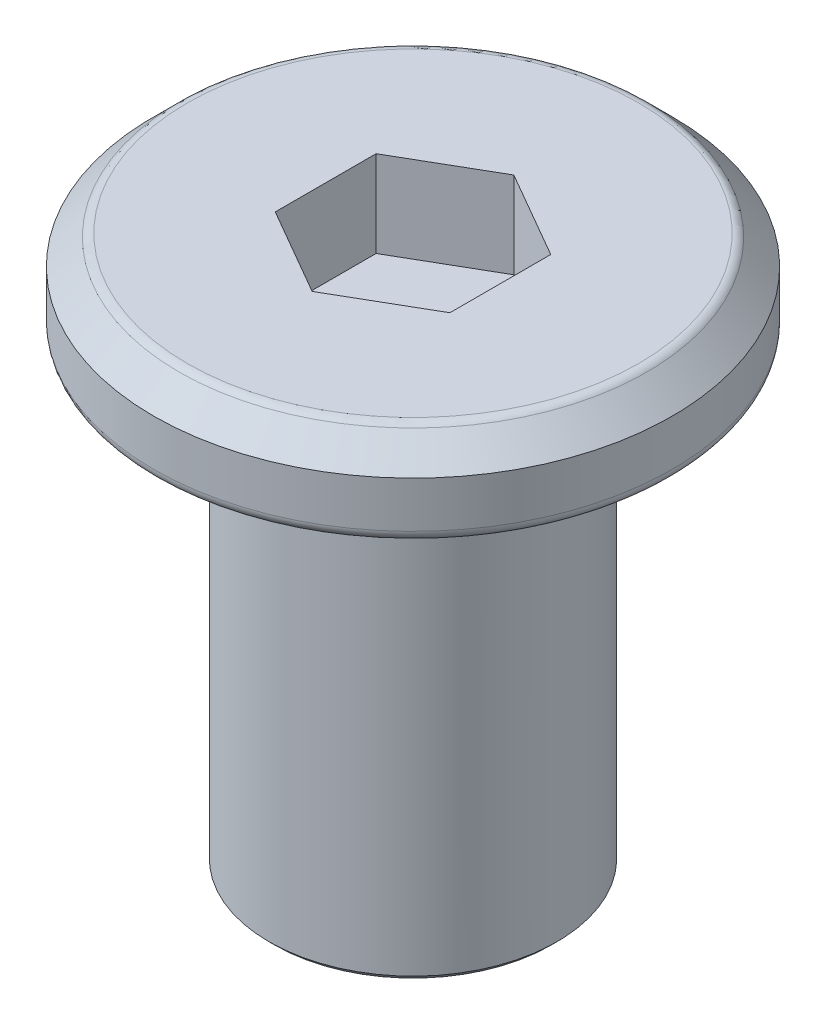
ISO-10303-21;
HEADER;
FILE_DESCRIPTION(('STEP AP214'),'2;1');
FILE_NAME('part.step','',(''),(''),'','','');
FILE_SCHEMA(('AUTOMOTIVE_DESIGN { 1 0 10303 214 1 1 1 1 }'));
ENDSEC;
DATA;
#1=APPLICATION_CONTEXT('core data for automotive mechanical design processes');
#2=APPLICATION_PROTOCOL_DEFINITION('international standard','automotive_design',2000,#1);
#3=PRODUCT_CONTEXT('',#1,'mechanical');
#4=PRODUCT('Part','Part','',(#3));
#5=PRODUCT_RELATED_PRODUCT_CATEGORY('part','',(#4));
#6=PRODUCT_DEFINITION_FORMATION('','',#4);
#7=PRODUCT_DEFINITION_CONTEXT('part definition',#1,'design');
#8=PRODUCT_DEFINITION('design','',#6,#7);
#9=PRODUCT_DEFINITION_SHAPE('','',#8);
#10=(LENGTH_UNIT() NAMED_UNIT(*) SI_UNIT(.MILLI.,.METRE.));
#11=(NAMED_UNIT(*) PLANE_ANGLE_UNIT() SI_UNIT($,.RADIAN.));
#12=(NAMED_UNIT(*) SI_UNIT($,.STERADIAN.) SOLID_ANGLE_UNIT());
#13=UNCERTAINTY_MEASURE_WITH_UNIT(LENGTH_MEASURE(1.E-05),#10,'distance_accuracy_value','');
#14=(GEOMETRIC_REPRESENTATION_CONTEXT(3) GLOBAL_UNCERTAINTY_ASSIGNED_CONTEXT((#13)) GLOBAL_UNIT_ASSIGNED_CONTEXT((#10,
#11,#12)) REPRESENTATION_CONTEXT('',''));
#15=CARTESIAN_POINT('',(0.,0.,0.));
#16=DIRECTION('',(0.,0.,1.));
#17=DIRECTION('',(1.,0.,0.));
#18=AXIS2_PLACEMENT_3D('',#15,#16,#17);
#19=CARTESIAN_POINT('',(0.,1.5,0.));
#20=DIRECTION('',(0.,-1.,0.));
#21=DIRECTION('',(0.,0.,-1.));
#22=AXIS2_PLACEMENT_3D('',#19,#20,#21);
#23=CYLINDRICAL_SURFACE('',#22,4.5);
#24=CARTESIAN_POINT('',(0.,0.2,0.));
#25=DIRECTION('',(0.,1.,0.));
#26=DIRECTION('',(0.,0.,1.));
#27=AXIS2_PLACEMENT_3D('',#24,#25,#26);
#28=CIRCLE('',#27,4.5);
#29=CARTESIAN_POINT('',(0.,0.2,4.5));
#30=VERTEX_POINT('',#29);
#31=EDGE_CURVE('E131',#30,#30,#28,.T.);
#32=ORIENTED_EDGE('',*,*,#31,.T.);
#33=EDGE_LOOP('',(#32));
#34=FACE_BOUND('',#33,.T.);
#35=CARTESIAN_POINT('',(0.,0.999999999999997,0.));
#36=DIRECTION('',(0.,1.,0.));
#37=DIRECTION('',(0.,0.,1.));
#38=AXIS2_PLACEMENT_3D('',#35,#36,#37);
#39=CIRCLE('',#38,4.5);
#40=CARTESIAN_POINT('',(0.,0.999999999999997,4.5));
#41=VERTEX_POINT('',#40);
#42=EDGE_CURVE('E117',#41,#41,#39,.F.);
#43=ORIENTED_EDGE('',*,*,#42,.T.);
#44=EDGE_LOOP('',(#43));
#45=FACE_BOUND('',#44,.T.);
#46=ADVANCED_FACE('F16',(#34,#45),#23,.T.);
#47=CARTESIAN_POINT('',(0.,1.5,0.));
#48=DIRECTION('',(0.,1.,0.));
#49=DIRECTION('',(0.,0.,1.));
#50=AXIS2_PLACEMENT_3D('',#47,#48,#49);
#51=PLANE('',#50);
#52=CARTESIAN_POINT('',(0.,1.5,0.));
#53=DIRECTION('',(0.,1.,0.));
#54=DIRECTION('',(0.,0.,1.));
#55=AXIS2_PLACEMENT_3D('',#52,#53,#54);
#56=CIRCLE('',#55,3.91715728752538);
#57=CARTESIAN_POINT('',(0.,1.5,3.91715728752538));
#58=VERTEX_POINT('',#57);
#59=EDGE_CURVE('E125',#58,#58,#56,.T.);
#60=ORIENTED_EDGE('',*,*,#59,.T.);
#61=EDGE_LOOP('',(#60));
#62=FACE_BOUND('',#61,.T.);
#63=DIRECTION('',(-0.866025403784438,0.,-0.5));
#64=VECTOR('',#63,1.);
#65=CARTESIAN_POINT('',(1.51554445662277,1.5,-0.875));
#66=LINE('',#65,#64);
#67=CARTESIAN_POINT('',(1.51554445662277,1.5,-0.875));
#68=VERTEX_POINT('',#67);
#69=CARTESIAN_POINT('',(0.,1.5,-1.75));
#70=VERTEX_POINT('',#69);
#71=EDGE_CURVE('E32',#68,#70,#66,.T.);
#72=ORIENTED_EDGE('',*,*,#71,.F.);
#73=DIRECTION('',(0.,0.,-1.));
#74=VECTOR('',#73,1.);
#75=CARTESIAN_POINT('',(1.51554445662277,1.5,0.875000000000001));
#76=LINE('',#75,#74);
#77=CARTESIAN_POINT('',(1.51554445662277,1.5,0.875000000000001));
#78=VERTEX_POINT('',#77);
#79=EDGE_CURVE('E113',#78,#68,#76,.T.);
#80=ORIENTED_EDGE('',*,*,#79,.F.);
#81=DIRECTION('',(0.866025403784439,0.,-0.5));
#82=VECTOR('',#81,1.);
#83=CARTESIAN_POINT('',(0.,1.5,1.75));
#84=LINE('',#83,#82);
#85=CARTESIAN_POINT('',(0.,1.5,1.75));
#86=VERTEX_POINT('',#85);
#87=EDGE_CURVE('E111',#86,#78,#84,.T.);
#88=ORIENTED_EDGE('',*,*,#87,.F.);
#89=DIRECTION('',(0.866025403784438,0.,0.5));
#90=VECTOR('',#89,1.);
#91=CARTESIAN_POINT('',(-1.51554445662277,1.5,0.874999999999999));
#92=LINE('',#91,#90);
#93=CARTESIAN_POINT('',(-1.51554445662277,1.5,0.874999999999999));
#94=VERTEX_POINT('',#93);
#95=EDGE_CURVE('E79',#94,#86,#92,.T.);
#96=ORIENTED_EDGE('',*,*,#95,.F.);
#97=DIRECTION('',(0.,0.,1.));
#98=VECTOR('',#97,1.);
#99=CARTESIAN_POINT('',(-1.51554445662277,1.5,-0.875));
#100=LINE('',#99,#98);
#101=CARTESIAN_POINT('',(-1.51554445662277,1.5,-0.875));
#102=VERTEX_POINT('',#101);
#103=EDGE_CURVE('E107',#102,#94,#100,.T.);
#104=ORIENTED_EDGE('',*,*,#103,.F.);
#105=DIRECTION('',(-0.866025403784439,0.,0.5));
#106=VECTOR('',#105,1.);
#107=CARTESIAN_POINT('',(0.,1.5,-1.75));
#108=LINE('',#107,#106);
#109=EDGE_CURVE('E104',#70,#102,#108,.T.);
#110=ORIENTED_EDGE('',*,*,#109,.F.);
#111=EDGE_LOOP('',(#72,#80,#88,#96,#104,#110));
#112=FACE_BOUND('',#111,.T.);
#113=ADVANCED_FACE('F158',(#62,#112),#51,.T.);
#114=CARTESIAN_POINT('',(0.,0.,0.));
#115=DIRECTION('',(0.,1.,0.));
#116=DIRECTION('',(0.,0.,1.));
#117=AXIS2_PLACEMENT_3D('',#114,#115,#116);
#118=PLANE('',#117);
#119=CARTESIAN_POINT('',(0.,0.,0.));
#120=DIRECTION('',(0.,1.,0.));
#121=DIRECTION('',(0.,0.,1.));
#122=AXIS2_PLACEMENT_3D('',#119,#120,#121);
#123=CIRCLE('',#122,2.75);
#124=CARTESIAN_POINT('',(0.,0.,2.75));
#125=VERTEX_POINT('',#124);
#126=EDGE_CURVE('E140',#125,#125,#123,.T.);
#127=ORIENTED_EDGE('',*,*,#126,.T.);
#128=EDGE_LOOP('',(#127));
#129=FACE_BOUND('',#128,.T.);
#130=CARTESIAN_POINT('',(0.,0.,0.));
#131=DIRECTION('',(0.,1.,0.));
#132=DIRECTION('',(0.,0.,1.));
#133=AXIS2_PLACEMENT_3D('',#130,#131,#132);
#134=CIRCLE('',#133,4.3);
#135=CARTESIAN_POINT('',(0.,0.,4.3));
#136=VERTEX_POINT('',#135);
#137=EDGE_CURVE('E134',#136,#136,#134,.F.);
#138=ORIENTED_EDGE('',*,*,#137,.T.);
#139=EDGE_LOOP('',(#138));
#140=FACE_BOUND('',#139,.T.);
#141=ADVANCED_FACE('F164',(#129,#140),#118,.F.);
#142=CARTESIAN_POINT('',(0.,1.5,0.));
#143=DIRECTION('',(0.,-1.,0.));
#144=DIRECTION('',(0.,0.,-1.));
#145=AXIS2_PLACEMENT_3D('',#142,#143,#144);
#146=CONICAL_SURFACE('',#145,4.,0.785398163397447);
#147=CARTESIAN_POINT('',(0.,1.44142135623731,0.));
#148=DIRECTION('',(0.,1.,0.));
#149=DIRECTION('',(0.,0.,1.));
#150=AXIS2_PLACEMENT_3D('',#147,#148,#149);
#151=CIRCLE('',#150,4.05857864376269);
#152=CARTESIAN_POINT('',(0.,1.44142135623731,4.05857864376269));
#153=VERTEX_POINT('',#152);
#154=EDGE_CURVE('E128',#153,#153,#151,.F.);
#155=ORIENTED_EDGE('',*,*,#154,.T.);
#156=EDGE_LOOP('',(#155));
#157=FACE_BOUND('',#156,.T.);
#158=ORIENTED_EDGE('',*,*,#42,.F.);
#159=EDGE_LOOP('',(#158));
#160=FACE_BOUND('',#159,.T.);
#161=ADVANCED_FACE('F170',(#157,#160),#146,.T.);
#162=CARTESIAN_POINT('',(1.51554445662277,0.,-0.875));
#163=DIRECTION('',(0.5,0.,-0.866025403784439));
#164=DIRECTION('',(-0.866025403784439,0.,-0.5));
#165=AXIS2_PLACEMENT_3D('',#162,#163,#164);
#166=PLANE('',#165);
#167=ORIENTED_EDGE('',*,*,#71,.T.);
#168=DIRECTION('',(0.,1.,0.));
#169=VECTOR('',#168,1.);
#170=CARTESIAN_POINT('',(0.,0.,-1.75));
#171=LINE('',#170,#169);
#172=CARTESIAN_POINT('',(0.,0.,-1.75));
#173=VERTEX_POINT('',#172);
#174=EDGE_CURVE('E63',#173,#70,#171,.T.);
#175=ORIENTED_EDGE('',*,*,#174,.F.);
#176=DIRECTION('',(-0.866025403784438,0.,-0.5));
#177=VECTOR('',#176,1.);
#178=CARTESIAN_POINT('',(1.51554445662277,0.,-0.875));
#179=LINE('',#178,#177);
#180=CARTESIAN_POINT('',(1.51554445662277,0.,-0.875));
#181=VERTEX_POINT('',#180);
#182=EDGE_CURVE('E115',#181,#173,#179,.T.);
#183=ORIENTED_EDGE('',*,*,#182,.F.);
#184=DIRECTION('',(0.,1.,0.));
#185=VECTOR('',#184,1.);
#186=CARTESIAN_POINT('',(1.51554445662277,0.,-0.875));
#187=LINE('',#186,#185);
#188=EDGE_CURVE('E40',#181,#68,#187,.T.);
#189=ORIENTED_EDGE('',*,*,#188,.T.);
#190=EDGE_LOOP('',(#167,#175,#183,#189));
#191=FACE_BOUND('',#190,.T.);
#192=ADVANCED_FACE('F173',(#191),#166,.F.);
#193=CARTESIAN_POINT('',(1.51554445662277,0.,0.875000000000001));
#194=DIRECTION('',(1.,0.,0.));
#195=DIRECTION('',(0.,0.,-1.));
#196=AXIS2_PLACEMENT_3D('',#193,#194,#195);
#197=PLANE('',#196);
#198=ORIENTED_EDGE('',*,*,#79,.T.);
#199=ORIENTED_EDGE('',*,*,#188,.F.);
#200=DIRECTION('',(0.,0.,-1.));
#201=VECTOR('',#200,1.);
#202=CARTESIAN_POINT('',(1.51554445662277,0.,0.875000000000001));
#203=LINE('',#202,#201);
#204=CARTESIAN_POINT('',(1.51554445662277,0.,0.875000000000001));
#205=VERTEX_POINT('',#204);
#206=EDGE_CURVE('E91',#205,#181,#203,.T.);
#207=ORIENTED_EDGE('',*,*,#206,.F.);
#208=DIRECTION('',(0.,1.,0.));
#209=VECTOR('',#208,1.);
#210=CARTESIAN_POINT('',(1.51554445662277,0.,0.875000000000001));
#211=LINE('',#210,#209);
#212=EDGE_CURVE('E83',#205,#78,#211,.T.);
#213=ORIENTED_EDGE('',*,*,#212,.T.);
#214=EDGE_LOOP('',(#198,#199,#207,#213));
#215=FACE_BOUND('',#214,.T.);
#216=ADVANCED_FACE('F207',(#215),#197,.F.);
#217=CARTESIAN_POINT('',(0.,0.,1.75));
#218=DIRECTION('',(0.5,0.,0.866025403784439));
#219=DIRECTION('',(0.866025403784439,0.,-0.5));
#220=AXIS2_PLACEMENT_3D('',#217,#218,#219);
#221=PLANE('',#220);
#222=ORIENTED_EDGE('',*,*,#87,.T.);
#223=ORIENTED_EDGE('',*,*,#212,.F.);
#224=DIRECTION('',(0.866025403784439,0.,-0.5));
#225=VECTOR('',#224,1.);
#226=CARTESIAN_POINT('',(0.,0.,1.75));
#227=LINE('',#226,#225);
#228=CARTESIAN_POINT('',(0.,0.,1.75));
#229=VERTEX_POINT('',#228);
#230=EDGE_CURVE('E87',#229,#205,#227,.T.);
#231=ORIENTED_EDGE('',*,*,#230,.F.);
#232=DIRECTION('',(0.,1.,0.));
#233=VECTOR('',#232,1.);
#234=CARTESIAN_POINT('',(0.,0.,1.75));
#235=LINE('',#234,#233);
#236=EDGE_CURVE('E72',#229,#86,#235,.T.);
#237=ORIENTED_EDGE('',*,*,#236,.T.);
#238=EDGE_LOOP('',(#222,#223,#231,#237));
#239=FACE_BOUND('',#238,.T.);
#240=ADVANCED_FACE('F88',(#239),#221,.F.);
#241=CARTESIAN_POINT('',(-1.51554445662277,0.,0.874999999999999));
#242=DIRECTION('',(-0.5,0.,0.866025403784438));
#243=DIRECTION('',(0.866025403784439,0.,0.5));
#244=AXIS2_PLACEMENT_3D('',#241,#242,#243);
#245=PLANE('',#244);
#246=ORIENTED_EDGE('',*,*,#95,.T.);
#247=ORIENTED_EDGE('',*,*,#236,.F.);
#248=DIRECTION('',(0.866025403784438,0.,0.5));
#249=VECTOR('',#248,1.);
#250=CARTESIAN_POINT('',(-1.51554445662277,0.,0.874999999999999));
#251=LINE('',#250,#249);
#252=CARTESIAN_POINT('',(-1.51554445662277,0.,0.874999999999999));
#253=VERTEX_POINT('',#252);
#254=EDGE_CURVE('E76',#253,#229,#251,.T.);
#255=ORIENTED_EDGE('',*,*,#254,.F.);
#256=DIRECTION('',(0.,1.,0.));
#257=VECTOR('',#256,1.);
#258=CARTESIAN_POINT('',(-1.51554445662277,0.,0.874999999999999));
#259=LINE('',#258,#257);
#260=EDGE_CURVE('E84',#253,#94,#259,.T.);
#261=ORIENTED_EDGE('',*,*,#260,.T.);
#262=EDGE_LOOP('',(#246,#247,#255,#261));
#263=FACE_BOUND('',#262,.T.);
#264=ADVANCED_FACE('F74',(#263),#245,.F.);
#265=CARTESIAN_POINT('',(-1.51554445662277,0.,-0.875));
#266=DIRECTION('',(-1.,0.,0.));
#267=DIRECTION('',(0.,0.,1.));
#268=AXIS2_PLACEMENT_3D('',#265,#266,#267);
#269=PLANE('',#268);
#270=ORIENTED_EDGE('',*,*,#103,.T.);
#271=ORIENTED_EDGE('',*,*,#260,.F.);
#272=DIRECTION('',(0.,0.,1.));
#273=VECTOR('',#272,1.);
#274=CARTESIAN_POINT('',(-1.51554445662277,0.,-0.875));
#275=LINE('',#274,#273);
#276=CARTESIAN_POINT('',(-1.51554445662277,0.,-0.875000000000001));
#277=VERTEX_POINT('',#276);
#278=EDGE_CURVE('E96',#277,#253,#275,.T.);
#279=ORIENTED_EDGE('',*,*,#278,.F.);
#280=DIRECTION('',(0.,1.,0.));
#281=VECTOR('',#280,1.);
#282=CARTESIAN_POINT('',(-1.51554445662277,0.,-0.875));
#283=LINE('',#282,#281);
#284=EDGE_CURVE('E120',#277,#102,#283,.T.);
#285=ORIENTED_EDGE('',*,*,#284,.T.);
#286=EDGE_LOOP('',(#270,#271,#279,#285));
#287=FACE_BOUND('',#286,.T.);
#288=ADVANCED_FACE('F214',(#287),#269,.F.);
#289=CARTESIAN_POINT('',(0.,0.,-1.75));
#290=DIRECTION('',(-0.5,0.,-0.866025403784439));
#291=DIRECTION('',(-0.866025403784439,0.,0.5));
#292=AXIS2_PLACEMENT_3D('',#289,#290,#291);
#293=PLANE('',#292);
#294=ORIENTED_EDGE('',*,*,#109,.T.);
#295=ORIENTED_EDGE('',*,*,#284,.F.);
#296=DIRECTION('',(-0.866025403784439,0.,0.5));
#297=VECTOR('',#296,1.);
#298=CARTESIAN_POINT('',(0.,0.,-1.75));
#299=LINE('',#298,#297);
#300=EDGE_CURVE('E98',#173,#277,#299,.T.);
#301=ORIENTED_EDGE('',*,*,#300,.F.);
#302=ORIENTED_EDGE('',*,*,#174,.T.);
#303=EDGE_LOOP('',(#294,#295,#301,#302));
#304=FACE_BOUND('',#303,.T.);
#305=ADVANCED_FACE('F204',(#304),#293,.F.);
#306=CARTESIAN_POINT('',(0.,0.,0.));
#307=DIRECTION('',(0.,-1.,0.));
#308=DIRECTION('',(0.,0.,-1.));
#309=AXIS2_PLACEMENT_3D('',#306,#307,#308);
#310=PLANE('',#309);
#311=ORIENTED_EDGE('',*,*,#206,.T.);
#312=ORIENTED_EDGE('',*,*,#182,.T.);
#313=ORIENTED_EDGE('',*,*,#300,.T.);
#314=ORIENTED_EDGE('',*,*,#278,.T.);
#315=ORIENTED_EDGE('',*,*,#254,.T.);
#316=ORIENTED_EDGE('',*,*,#230,.T.);
#317=EDGE_LOOP('',(#311,#312,#313,#314,#315,#316));
#318=FACE_BOUND('',#317,.T.);
#319=ADVANCED_FACE('F93',(#318),#310,.F.);
#320=CARTESIAN_POINT('',(0.,-8.,0.));
#321=DIRECTION('',(0.,1.,0.));
#322=DIRECTION('',(0.,0.,1.));
#323=AXIS2_PLACEMENT_3D('',#320,#321,#322);
#324=CYLINDRICAL_SURFACE('',#323,2.5);
#325=CARTESIAN_POINT('',(0.,-7.9,0.));
#326=DIRECTION('',(0.,-1.,0.));
#327=DIRECTION('',(0.,0.,-1.));
#328=AXIS2_PLACEMENT_3D('',#325,#326,#327);
#329=CIRCLE('',#328,2.5);
#330=CARTESIAN_POINT('',(0.,-7.9,-2.5));
#331=VERTEX_POINT('',#330);
#332=EDGE_CURVE('E10',#331,#331,#329,.F.);
#333=ORIENTED_EDGE('',*,*,#332,.T.);
#334=EDGE_LOOP('',(#333));
#335=FACE_BOUND('',#334,.T.);
#336=CARTESIAN_POINT('',(0.,-0.25,0.));
#337=DIRECTION('',(0.,1.,0.));
#338=DIRECTION('',(0.,0.,1.));
#339=AXIS2_PLACEMENT_3D('',#336,#337,#338);
#340=CIRCLE('',#339,2.5);
#341=CARTESIAN_POINT('',(0.,-0.25,2.5));
#342=VERTEX_POINT('',#341);
#343=EDGE_CURVE('E137',#342,#342,#340,.F.);
#344=ORIENTED_EDGE('',*,*,#343,.T.);
#345=EDGE_LOOP('',(#344));
#346=FACE_BOUND('',#345,.T.);
#347=ADVANCED_FACE('F195',(#335,#346),#324,.T.);
#348=CARTESIAN_POINT('',(0.,-8.,0.));
#349=DIRECTION('',(0.,-1.,0.));
#350=DIRECTION('',(0.,0.,-1.));
#351=AXIS2_PLACEMENT_3D('',#348,#349,#350);
#352=PLANE('',#351);
#353=CARTESIAN_POINT('',(0.,-8.,0.));
#354=DIRECTION('',(0.,-1.,0.));
#355=DIRECTION('',(0.,0.,-1.));
#356=AXIS2_PLACEMENT_3D('',#353,#354,#355);
#357=CIRCLE('',#356,2.4);
#358=CARTESIAN_POINT('',(0.,-8.,-2.4));
#359=VERTEX_POINT('',#358);
#360=EDGE_CURVE('E25',#359,#359,#357,.T.);
#361=ORIENTED_EDGE('',*,*,#360,.T.);
#362=EDGE_LOOP('',(#361));
#363=FACE_BOUND('',#362,.T.);
#364=ADVANCED_FACE('F145',(#363),#352,.T.);
#365=CARTESIAN_POINT('',(0.,1.3,0.));
#366=DIRECTION('',(0.,1.,0.));
#367=DIRECTION('',(0.,0.,1.));
#368=AXIS2_PLACEMENT_3D('',#365,#366,#367);
#369=TOROIDAL_SURFACE('',#368,3.91715728752538,0.2);
#370=ORIENTED_EDGE('',*,*,#154,.F.);
#371=EDGE_LOOP('',(#370));
#372=FACE_BOUND('',#371,.T.);
#373=ORIENTED_EDGE('',*,*,#59,.F.);
#374=EDGE_LOOP('',(#373));
#375=FACE_BOUND('',#374,.T.);
#376=ADVANCED_FACE('F175',(#372,#375),#369,.T.);
#377=CARTESIAN_POINT('',(0.,0.2,0.));
#378=DIRECTION('',(0.,1.,0.));
#379=DIRECTION('',(0.,0.,1.));
#380=AXIS2_PLACEMENT_3D('',#377,#378,#379);
#381=TOROIDAL_SURFACE('',#380,4.3,0.2);
#382=ORIENTED_EDGE('',*,*,#137,.F.);
#383=EDGE_LOOP('',(#382));
#384=FACE_BOUND('',#383,.T.);
#385=ORIENTED_EDGE('',*,*,#31,.F.);
#386=EDGE_LOOP('',(#385));
#387=FACE_BOUND('',#386,.T.);
#388=ADVANCED_FACE('F154',(#384,#387),#381,.T.);
#389=CARTESIAN_POINT('',(0.,-0.25,0.));
#390=DIRECTION('',(0.,1.,0.));
#391=DIRECTION('',(0.,0.,1.));
#392=AXIS2_PLACEMENT_3D('',#389,#390,#391);
#393=TOROIDAL_SURFACE('',#392,2.75,0.25);
#394=ORIENTED_EDGE('',*,*,#126,.F.);
#395=EDGE_LOOP('',(#394));
#396=FACE_BOUND('',#395,.T.);
#397=ORIENTED_EDGE('',*,*,#343,.F.);
#398=EDGE_LOOP('',(#397));
#399=FACE_BOUND('',#398,.T.);
#400=ADVANCED_FACE('F148',(#396,#399),#393,.F.);
#401=CARTESIAN_POINT('',(0.,-8.,0.));
#402=DIRECTION('',(0.,1.,0.));
#403=DIRECTION('',(0.,0.,1.));
#404=AXIS2_PLACEMENT_3D('',#401,#402,#403);
#405=CONICAL_SURFACE('',#404,2.4,0.785398163397438);
#406=ORIENTED_EDGE('',*,*,#332,.F.);
#407=EDGE_LOOP('',(#406));
#408=FACE_BOUND('',#407,.T.);
#409=ORIENTED_EDGE('',*,*,#360,.F.);
#410=EDGE_LOOP('',(#409));
#411=FACE_BOUND('',#410,.T.);
#412=ADVANCED_FACE('F19',(#408,#411),#405,.T.);
#413=CLOSED_SHELL('',(#46,#113,#141,#161,#192,#216,#240,#264,#288,#305,#319,#347,#364,#376,#388,
#400,#412));
#414=MANIFOLD_SOLID_BREP('B1',#413);
#415=ADVANCED_BREP_SHAPE_REPRESENTATION('',(#18,#414),#14);
#416=SHAPE_DEFINITION_REPRESENTATION(#9,#415);
ENDSEC;
END-ISO-10303-21;
